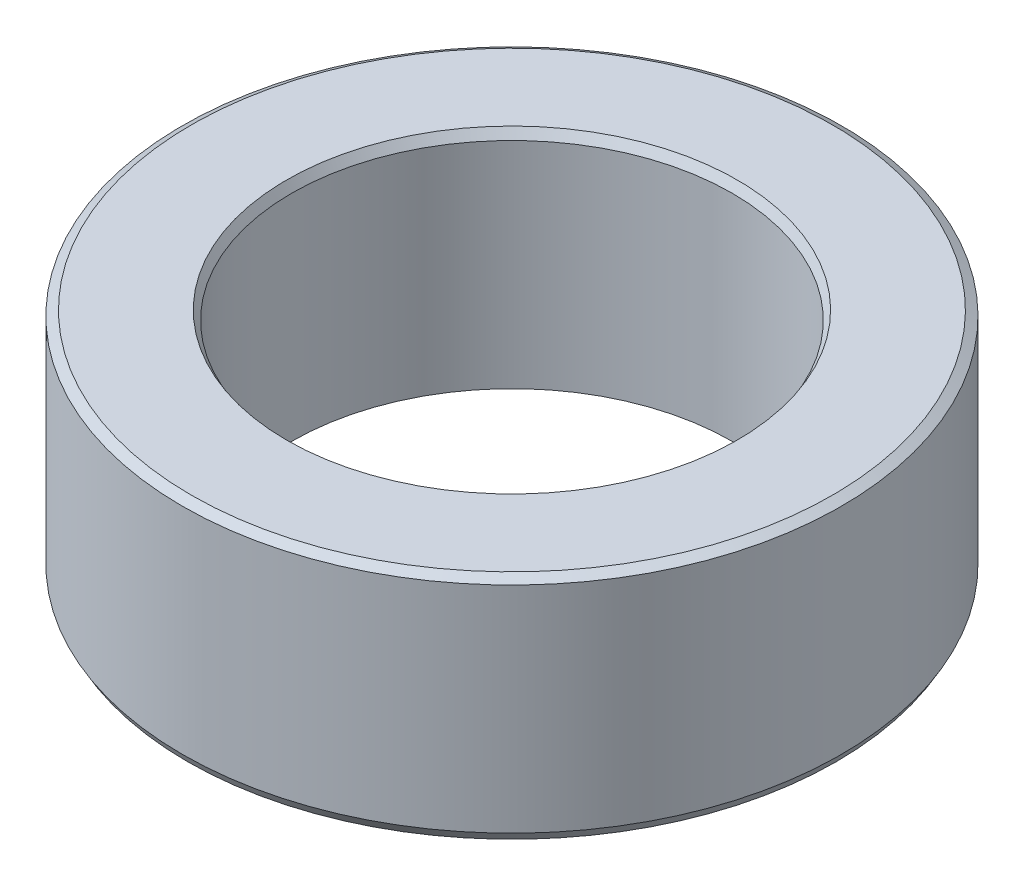
ISO-10303-21;
HEADER;
FILE_DESCRIPTION(('STEP AP214'),'2;1');
FILE_NAME('part.step','',(''),(''),'','','');
FILE_SCHEMA(('AUTOMOTIVE_DESIGN { 1 0 10303 214 1 1 1 1 }'));
ENDSEC;
DATA;
#1=APPLICATION_CONTEXT('core data for automotive mechanical design processes');
#2=APPLICATION_PROTOCOL_DEFINITION('international standard','automotive_design',2000,#1);
#3=PRODUCT_CONTEXT('',#1,'mechanical');
#4=PRODUCT('Part','Part','',(#3));
#5=PRODUCT_RELATED_PRODUCT_CATEGORY('part','',(#4));
#6=PRODUCT_DEFINITION_FORMATION('','',#4);
#7=PRODUCT_DEFINITION_CONTEXT('part definition',#1,'design');
#8=PRODUCT_DEFINITION('design','',#6,#7);
#9=PRODUCT_DEFINITION_SHAPE('','',#8);
#10=(LENGTH_UNIT() NAMED_UNIT(*) SI_UNIT(.MILLI.,.METRE.));
#11=(NAMED_UNIT(*) PLANE_ANGLE_UNIT() SI_UNIT($,.RADIAN.));
#12=(NAMED_UNIT(*) SI_UNIT($,.STERADIAN.) SOLID_ANGLE_UNIT());
#13=UNCERTAINTY_MEASURE_WITH_UNIT(LENGTH_MEASURE(1.E-05),#10,'distance_accuracy_value','');
#14=(GEOMETRIC_REPRESENTATION_CONTEXT(3) GLOBAL_UNCERTAINTY_ASSIGNED_CONTEXT((#13)) GLOBAL_UNIT_ASSIGNED_CONTEXT((#10,
#11,#12)) REPRESENTATION_CONTEXT('',''));
#15=CARTESIAN_POINT('',(0.,0.,0.));
#16=DIRECTION('',(0.,0.,1.));
#17=DIRECTION('',(1.,0.,0.));
#18=AXIS2_PLACEMENT_3D('',#15,#16,#17);
#19=CARTESIAN_POINT('',(0.,22.5777201236958,0.));
#20=DIRECTION('',(0.,-1.,0.));
#21=DIRECTION('',(0.,0.,-1.));
#22=AXIS2_PLACEMENT_3D('',#19,#20,#21);
#23=CYLINDRICAL_SURFACE('',#22,32.5);
#24=CARTESIAN_POINT('',(0.,0.876596047560511,0.));
#25=DIRECTION('',(0.,1.,0.));
#26=DIRECTION('',(0.,0.,1.));
#27=AXIS2_PLACEMENT_3D('',#24,#25,#26);
#28=CIRCLE('',#27,32.5);
#29=CARTESIAN_POINT('',(0.,0.876596047560511,32.5));
#30=VERTEX_POINT('',#29);
#31=EDGE_CURVE('E10',#30,#30,#28,.T.);
#32=ORIENTED_EDGE('',*,*,#31,.T.);
#33=EDGE_LOOP('',(#32));
#34=FACE_BOUND('',#33,.T.);
#35=CARTESIAN_POINT('',(0.,22.0716171596662,0.));
#36=DIRECTION('',(0.,1.,0.));
#37=DIRECTION('',(0.,0.,1.));
#38=AXIS2_PLACEMENT_3D('',#35,#36,#37);
#39=CIRCLE('',#38,32.5);
#40=CARTESIAN_POINT('',(0.,22.0716171596662,32.5));
#41=VERTEX_POINT('',#40);
#42=EDGE_CURVE('E50',#41,#41,#39,.F.);
#43=ORIENTED_EDGE('',*,*,#42,.T.);
#44=EDGE_LOOP('',(#43));
#45=FACE_BOUND('',#44,.T.);
#46=ADVANCED_FACE('F39',(#34,#45),#23,.T.);
#47=CARTESIAN_POINT('',(0.,22.5777201236958,0.));
#48=DIRECTION('',(0.,1.,0.));
#49=DIRECTION('',(0.,0.,1.));
#50=AXIS2_PLACEMENT_3D('',#47,#48,#49);
#51=PLANE('',#50);
#52=CARTESIAN_POINT('',(0.,22.5777201236958,0.));
#53=DIRECTION('',(0.,1.,0.));
#54=DIRECTION('',(0.,0.,1.));
#55=AXIS2_PLACEMENT_3D('',#52,#53,#54);
#56=CIRCLE('',#55,22.2215326072123);
#57=CARTESIAN_POINT('',(0.,22.5777201236958,22.2215326072123));
#58=VERTEX_POINT('',#57);
#59=EDGE_CURVE('E58',#58,#58,#56,.F.);
#60=ORIENTED_EDGE('',*,*,#59,.T.);
#61=EDGE_LOOP('',(#60));
#62=FACE_BOUND('',#61,.T.);
#63=CARTESIAN_POINT('',(0.,22.5777201236958,0.));
#64=DIRECTION('',(0.,1.,0.));
#65=DIRECTION('',(0.,0.,1.));
#66=AXIS2_PLACEMENT_3D('',#63,#64,#65);
#67=CIRCLE('',#66,31.6234039524395);
#68=CARTESIAN_POINT('',(0.,22.5777201236958,31.6234039524395));
#69=VERTEX_POINT('',#68);
#70=EDGE_CURVE('E61',#69,#69,#67,.T.);
#71=ORIENTED_EDGE('',*,*,#70,.T.);
#72=EDGE_LOOP('',(#71));
#73=FACE_BOUND('',#72,.T.);
#74=ADVANCED_FACE('F88',(#62,#73),#51,.T.);
#75=CARTESIAN_POINT('',(0.,0.,0.));
#76=DIRECTION('',(0.,1.,0.));
#77=DIRECTION('',(0.,0.,1.));
#78=AXIS2_PLACEMENT_3D('',#75,#76,#77);
#79=PLANE('',#78);
#80=CARTESIAN_POINT('',(0.,0.,0.));
#81=DIRECTION('',(0.,1.,0.));
#82=DIRECTION('',(0.,0.,1.));
#83=AXIS2_PLACEMENT_3D('',#80,#81,#82);
#84=CIRCLE('',#83,22.5920256907432);
#85=CARTESIAN_POINT('',(0.,0.,22.5920256907432));
#86=VERTEX_POINT('',#85);
#87=EDGE_CURVE('E51',#86,#86,#84,.T.);
#88=ORIENTED_EDGE('',*,*,#87,.T.);
#89=EDGE_LOOP('',(#88));
#90=FACE_BOUND('',#89,.T.);
#91=CARTESIAN_POINT('',(0.,0.,0.));
#92=DIRECTION('',(0.,1.,0.));
#93=DIRECTION('',(0.,0.,1.));
#94=AXIS2_PLACEMENT_3D('',#91,#92,#93);
#95=CIRCLE('',#94,31.9938970359704);
#96=CARTESIAN_POINT('',(0.,0.,31.9938970359704));
#97=VERTEX_POINT('',#96);
#98=EDGE_CURVE('E54',#97,#97,#95,.F.);
#99=ORIENTED_EDGE('',*,*,#98,.T.);
#100=EDGE_LOOP('',(#99));
#101=FACE_BOUND('',#100,.T.);
#102=ADVANCED_FACE('F83',(#90,#101),#79,.F.);
#103=CARTESIAN_POINT('',(0.,22.5777201236958,0.));
#104=DIRECTION('',(0.,-1.,0.));
#105=DIRECTION('',(0.,0.,-1.));
#106=AXIS2_PLACEMENT_3D('',#103,#104,#105);
#107=CYLINDRICAL_SURFACE('',#106,21.7154296431826);
#108=CARTESIAN_POINT('',(0.,21.7011240761352,0.));
#109=DIRECTION('',(0.,1.,0.));
#110=DIRECTION('',(0.,0.,1.));
#111=AXIS2_PLACEMENT_3D('',#108,#109,#110);
#112=CIRCLE('',#111,21.7154296431826);
#113=CARTESIAN_POINT('',(0.,21.7011240761352,21.7154296431826));
#114=VERTEX_POINT('',#113);
#115=EDGE_CURVE('E67',#114,#114,#112,.T.);
#116=ORIENTED_EDGE('',*,*,#115,.T.);
#117=EDGE_LOOP('',(#116));
#118=FACE_BOUND('',#117,.T.);
#119=CARTESIAN_POINT('',(0.,0.506102964029656,0.));
#120=DIRECTION('',(0.,1.,0.));
#121=DIRECTION('',(0.,0.,1.));
#122=AXIS2_PLACEMENT_3D('',#119,#120,#121);
#123=CIRCLE('',#122,21.7154296431826);
#124=CARTESIAN_POINT('',(0.,0.506102964029656,21.7154296431826));
#125=VERTEX_POINT('',#124);
#126=EDGE_CURVE('E69',#125,#125,#123,.F.);
#127=ORIENTED_EDGE('',*,*,#126,.T.);
#128=EDGE_LOOP('',(#127));
#129=FACE_BOUND('',#128,.T.);
#130=ADVANCED_FACE('F71',(#118,#129),#107,.F.);
#131=CARTESIAN_POINT('',(0.,21.7011240761352,0.));
#132=DIRECTION('',(0.,1.,0.));
#133=DIRECTION('',(0.,0.,1.));
#134=AXIS2_PLACEMENT_3D('',#131,#132,#133);
#135=CONICAL_SURFACE('',#134,21.7154296431826,0.523598775598302);
#136=ORIENTED_EDGE('',*,*,#59,.F.);
#137=EDGE_LOOP('',(#136));
#138=FACE_BOUND('',#137,.T.);
#139=ORIENTED_EDGE('',*,*,#115,.F.);
#140=EDGE_LOOP('',(#139));
#141=FACE_BOUND('',#140,.T.);
#142=ADVANCED_FACE('F77',(#138,#141),#135,.F.);
#143=CARTESIAN_POINT('',(0.,0.,0.));
#144=DIRECTION('',(0.,-1.,0.));
#145=DIRECTION('',(0.,0.,-1.));
#146=AXIS2_PLACEMENT_3D('',#143,#144,#145);
#147=CONICAL_SURFACE('',#146,22.5920256907432,1.04719755119659);
#148=ORIENTED_EDGE('',*,*,#126,.F.);
#149=EDGE_LOOP('',(#148));
#150=FACE_BOUND('',#149,.T.);
#151=ORIENTED_EDGE('',*,*,#87,.F.);
#152=EDGE_LOOP('',(#151));
#153=FACE_BOUND('',#152,.T.);
#154=ADVANCED_FACE('F73',(#150,#153),#147,.F.);
#155=CARTESIAN_POINT('',(0.,0.876596047560511,0.));
#156=DIRECTION('',(0.,1.,0.));
#157=DIRECTION('',(0.,0.,1.));
#158=AXIS2_PLACEMENT_3D('',#155,#156,#157);
#159=CONICAL_SURFACE('',#158,32.5,0.523598775598303);
#160=CARTESIAN_POINT('',(0.,0.,31.9938970359704));
#161=CARTESIAN_POINT('',(0.,0.00913120882875522,31.9991689418457));
#162=CARTESIAN_POINT('',(0.,0.0182624176575105,32.004440847721));
#163=CARTESIAN_POINT('',(0.,0.0365248353150212,32.0149846594716));
#164=CARTESIAN_POINT('',(0.,0.0456560441437765,32.0202565653469));
#165=CARTESIAN_POINT('',(0.,0.0639184618012872,32.0308003770975));
#166=CARTESIAN_POINT('',(0.,0.0730496706300425,32.0360722829728));
#167=CARTESIAN_POINT('',(0.,0.0913120882875532,32.0466160947235));
#168=CARTESIAN_POINT('',(0.,0.100443297116309,32.0518880005988));
#169=CARTESIAN_POINT('',(0.,0.118705714773819,32.0624318123494));
#170=CARTESIAN_POINT('',(0.,0.127836923602574,32.0677037182247));
#171=CARTESIAN_POINT('',(0.,0.146099341260085,32.0782475299753));
#172=CARTESIAN_POINT('',(0.,0.155230550088841,32.0835194358506));
#173=CARTESIAN_POINT('',(0.,0.173492967746351,32.0940632476012));
#174=CARTESIAN_POINT('',(0.,0.182624176575106,32.0993351534766));
#175=CARTESIAN_POINT('',(0.,0.200886594232617,32.1098789652272));
#176=CARTESIAN_POINT('',(0.,0.210017803061373,32.1151508711025));
#177=CARTESIAN_POINT('',(0.,0.228280220718884,32.1256946828531));
#178=CARTESIAN_POINT('',(0.,0.237411429547639,32.1309665887284));
#179=CARTESIAN_POINT('',(0.,0.255673847205149,32.141510400479));
#180=CARTESIAN_POINT('',(0.,0.264805056033904,32.1467823063543));
#181=CARTESIAN_POINT('',(0.,0.283067473691415,32.1573261181049));
#182=CARTESIAN_POINT('',(0.,0.29219868252017,32.1625980239803));
#183=CARTESIAN_POINT('',(0.,0.310461100177681,32.1731418357309));
#184=CARTESIAN_POINT('',(0.,0.319592309006436,32.1784137416062));
#185=CARTESIAN_POINT('',(0.,0.337854726663947,32.1889575533568));
#186=CARTESIAN_POINT('',(0.,0.346985935492702,32.1942294592321));
#187=CARTESIAN_POINT('',(0.,0.365248353150213,32.2047732709827));
#188=CARTESIAN_POINT('',(0.,0.374379561978968,32.210045176858));
#189=CARTESIAN_POINT('',(0.,0.392641979636479,32.2205889886086));
#190=CARTESIAN_POINT('',(0.,0.401773188465234,32.225860894484));
#191=CARTESIAN_POINT('',(0.,0.420035606122745,32.2364047062346));
#192=CARTESIAN_POINT('',(0.,0.4291668149515,32.2416766121099));
#193=CARTESIAN_POINT('',(0.,0.447429232609011,32.2522204238605));
#194=CARTESIAN_POINT('',(0.,0.456560441437766,32.2574923297358));
#195=CARTESIAN_POINT('',(0.,0.474822859095277,32.2680361414864));
#196=CARTESIAN_POINT('',(0.,0.483954067924032,32.2733080473617));
#197=CARTESIAN_POINT('',(0.,0.502216485581543,32.2838518591123));
#198=CARTESIAN_POINT('',(0.,0.511347694410298,32.2891237649877));
#199=CARTESIAN_POINT('',(0.,0.529610112067809,32.2996675767383));
#200=CARTESIAN_POINT('',(0.,0.538741320896564,32.3049394826136));
#201=CARTESIAN_POINT('',(0.,0.557003738554075,32.3154832943642));
#202=CARTESIAN_POINT('',(0.,0.56613494738283,32.3207552002395));
#203=CARTESIAN_POINT('',(0.,0.584397365040341,32.3312990119901));
#204=CARTESIAN_POINT('',(0.,0.593528573869096,32.3365709178654));
#205=CARTESIAN_POINT('',(0.,0.611790991526607,32.3471147296161));
#206=CARTESIAN_POINT('',(0.,0.620922200355362,32.3523866354914));
#207=CARTESIAN_POINT('',(0.,0.639184618012873,32.362930447242));
#208=CARTESIAN_POINT('',(0.,0.648315826841628,32.3682023531173));
#209=CARTESIAN_POINT('',(0.,0.666578244499139,32.3787461648679));
#210=CARTESIAN_POINT('',(0.,0.675709453327894,32.3840180707432));
#211=CARTESIAN_POINT('',(0.,0.693971870985405,32.3945618824938));
#212=CARTESIAN_POINT('',(0.,0.70310307981416,32.3998337883691));
#213=CARTESIAN_POINT('',(0.,0.721365497471671,32.4103776001198));
#214=CARTESIAN_POINT('',(0.,0.730496706300426,32.4156495059951));
#215=CARTESIAN_POINT('',(0.,0.748759123957937,32.4261933177457));
#216=CARTESIAN_POINT('',(0.,0.757890332786692,32.431465223621));
#217=CARTESIAN_POINT('',(0.,0.776152750444203,32.4420090353716));
#218=CARTESIAN_POINT('',(0.,0.785283959272958,32.4472809412469));
#219=CARTESIAN_POINT('',(0.,0.803546376930469,32.4578247529975));
#220=CARTESIAN_POINT('',(0.,0.812677585759224,32.4630966588728));
#221=CARTESIAN_POINT('',(0.,0.830940003416735,32.4736404706235));
#222=CARTESIAN_POINT('',(0.,0.84007121224549,32.4789123764988));
#223=CARTESIAN_POINT('',(0.,0.858333629903001,32.4894561882494));
#224=CARTESIAN_POINT('',(0.,0.867464838731756,32.4947280941247));
#225=CARTESIAN_POINT('',(0.,0.876596047560511,32.5));
#226=B_SPLINE_CURVE_WITH_KNOTS('',3,(#160,#161,#162,#163,#164,#165,#166,#167,#168,#169,#170,
#171,#172,#173,#174,#175,#176,#177,#178,#179,#180,#181,#182,#183,#184,#185,#186,#187,#188,#189,
#190,#191,#192,#193,#194,#195,#196,#197,#198,#199,#200,#201,#202,#203,#204,#205,#206,#207,#208,
#209,#210,#211,#212,#213,#214,#215,#216,#217,#218,#219,#220,#221,#222,#223,#224,#225),
.UNSPECIFIED.,.F.,.F.,(4,2,2,2,2,2,2,2,2,2,2,2,2,2,2,2,2,2,2,2,2,2,2,2,2,2,2,2,2,2,2,2,4),(0.,
0.0316314352518517,0.0632628705037035,0.0948943057555553,0.126525741007407,0.158157176259259,
0.18978861151111,0.221420046762962,0.253051482014811,0.284682917266662,0.316314352518514,
0.347945787770366,0.379577223022218,0.411208658274069,0.442840093525921,0.474471528777773,
0.506102964029625,0.537734399281476,0.569365834533328,0.60099726978518,0.632628705037032,
0.664260140288884,0.695891575540735,0.727523010792587,0.759154446044435,0.790785881296287,
0.822417316548139,0.854048751799991,0.885680187051842,0.917311622303694,0.948943057555546,
0.980574492807398,1.01220592805925),.UNSPECIFIED.);
#227=EDGE_CURVE('BSEAM76',#97,#30,#226,.T.);
#228=ORIENTED_EDGE('',*,*,#98,.F.);
#229=ORIENTED_EDGE('',*,*,#31,.F.);
#230=ORIENTED_EDGE('',*,*,#227,.T.);
#231=ORIENTED_EDGE('',*,*,#227,.F.);
#232=EDGE_LOOP('',(#228,#230,#229,#231));
#233=FACE_BOUND('',#232,.T.);
#234=ADVANCED_FACE('F76',(#233),#159,.T.);
#235=CARTESIAN_POINT('',(0.,22.5777201236958,0.));
#236=DIRECTION('',(0.,-1.,0.));
#237=DIRECTION('',(0.,0.,-1.));
#238=AXIS2_PLACEMENT_3D('',#235,#236,#237);
#239=CONICAL_SURFACE('',#238,31.6234039524395,1.0471975511966);
#240=ORIENTED_EDGE('',*,*,#42,.F.);
#241=EDGE_LOOP('',(#240));
#242=FACE_BOUND('',#241,.T.);
#243=ORIENTED_EDGE('',*,*,#70,.F.);
#244=EDGE_LOOP('',(#243));
#245=FACE_BOUND('',#244,.T.);
#246=ADVANCED_FACE('F45',(#242,#245),#239,.T.);
#247=CLOSED_SHELL('',(#46,#74,#102,#130,#142,#154,#234,#246));
#248=MANIFOLD_SOLID_BREP('B2',#247);
#249=ADVANCED_BREP_SHAPE_REPRESENTATION('',(#18,#248),#14);
#250=SHAPE_DEFINITION_REPRESENTATION(#9,#249);
ENDSEC;
END-ISO-10303-21;
